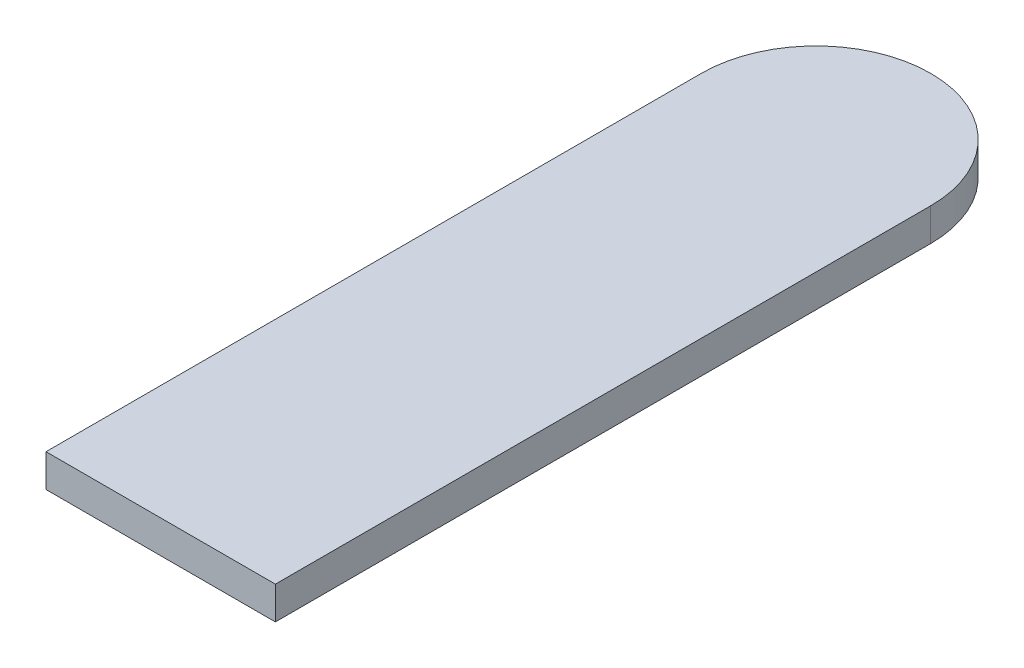
ISO-10303-21;
HEADER;
FILE_DESCRIPTION(('STEP AP214'),'2;1');
FILE_NAME('part.step','',(''),(''),'','','');
FILE_SCHEMA(('AUTOMOTIVE_DESIGN { 1 0 10303 214 1 1 1 1 }'));
ENDSEC;
DATA;
#1=APPLICATION_CONTEXT('core data for automotive mechanical design processes');
#2=APPLICATION_PROTOCOL_DEFINITION('international standard','automotive_design',2000,#1);
#3=PRODUCT_CONTEXT('',#1,'mechanical');
#4=PRODUCT('Part','Part','',(#3));
#5=PRODUCT_RELATED_PRODUCT_CATEGORY('part','',(#4));
#6=PRODUCT_DEFINITION_FORMATION('','',#4);
#7=PRODUCT_DEFINITION_CONTEXT('part definition',#1,'design');
#8=PRODUCT_DEFINITION('design','',#6,#7);
#9=PRODUCT_DEFINITION_SHAPE('','',#8);
#10=(LENGTH_UNIT() NAMED_UNIT(*) SI_UNIT(.MILLI.,.METRE.));
#11=(NAMED_UNIT(*) PLANE_ANGLE_UNIT() SI_UNIT($,.RADIAN.));
#12=(NAMED_UNIT(*) SI_UNIT($,.STERADIAN.) SOLID_ANGLE_UNIT());
#13=UNCERTAINTY_MEASURE_WITH_UNIT(LENGTH_MEASURE(1.E-05),#10,'distance_accuracy_value','');
#14=(GEOMETRIC_REPRESENTATION_CONTEXT(3) GLOBAL_UNCERTAINTY_ASSIGNED_CONTEXT((#13)) GLOBAL_UNIT_ASSIGNED_CONTEXT((#10,
#11,#12)) REPRESENTATION_CONTEXT('',''));
#15=CARTESIAN_POINT('',(0.,0.,0.));
#16=DIRECTION('',(0.,0.,1.));
#17=DIRECTION('',(1.,0.,0.));
#18=AXIS2_PLACEMENT_3D('',#15,#16,#17);
#19=CARTESIAN_POINT('',(0.,1.,0.));
#20=DIRECTION('',(-1.,0.,0.));
#21=DIRECTION('',(0.,0.,1.));
#22=AXIS2_PLACEMENT_3D('',#19,#20,#21);
#23=PLANE('',#22);
#24=DIRECTION('',(0.,0.,-1.));
#25=VECTOR('',#24,1.);
#26=CARTESIAN_POINT('',(0.,0.,0.));
#27=LINE('',#26,#25);
#28=CARTESIAN_POINT('',(0.,0.,0.));
#29=VERTEX_POINT('',#28);
#30=CARTESIAN_POINT('',(0.,0.,-20.));
#31=VERTEX_POINT('',#30);
#32=EDGE_CURVE('E107',#29,#31,#27,.T.);
#33=ORIENTED_EDGE('',*,*,#32,.T.);
#34=DIRECTION('',(0.,-1.,0.));
#35=VECTOR('',#34,1.);
#36=CARTESIAN_POINT('',(0.,1.,-20.));
#37=LINE('',#36,#35);
#38=CARTESIAN_POINT('',(0.,1.,-20.));
#39=VERTEX_POINT('',#38);
#40=EDGE_CURVE('E11',#39,#31,#37,.T.);
#41=ORIENTED_EDGE('',*,*,#40,.F.);
#42=DIRECTION('',(0.,0.,-1.));
#43=VECTOR('',#42,1.);
#44=CARTESIAN_POINT('',(0.,1.,0.));
#45=LINE('',#44,#43);
#46=CARTESIAN_POINT('',(0.,1.,0.));
#47=VERTEX_POINT('',#46);
#48=EDGE_CURVE('E91',#47,#39,#45,.T.);
#49=ORIENTED_EDGE('',*,*,#48,.F.);
#50=DIRECTION('',(0.,-1.,0.));
#51=VECTOR('',#50,1.);
#52=CARTESIAN_POINT('',(0.,1.,0.));
#53=LINE('',#52,#51);
#54=EDGE_CURVE('E103',#47,#29,#53,.T.);
#55=ORIENTED_EDGE('',*,*,#54,.T.);
#56=EDGE_LOOP('',(#33,#41,#49,#55));
#57=FACE_BOUND('',#56,.T.);
#58=ADVANCED_FACE('F39',(#57),#23,.F.);
#59=CARTESIAN_POINT('',(-3.5,1.,-20.));
#60=DIRECTION('',(0.,-1.,0.));
#61=DIRECTION('',(0.,0.,-1.));
#62=AXIS2_PLACEMENT_3D('',#59,#60,#61);
#63=CYLINDRICAL_SURFACE('',#62,3.5);
#64=CARTESIAN_POINT('',(-3.5,0.,-20.));
#65=DIRECTION('',(0.,1.,0.));
#66=DIRECTION('',(0.,0.,-1.));
#67=AXIS2_PLACEMENT_3D('',#64,#65,#66);
#68=CIRCLE('',#67,3.5);
#69=CARTESIAN_POINT('',(-7.,0.,-20.));
#70=VERTEX_POINT('',#69);
#71=EDGE_CURVE('E96',#31,#70,#68,.T.);
#72=ORIENTED_EDGE('',*,*,#71,.T.);
#73=DIRECTION('',(0.,-1.,0.));
#74=VECTOR('',#73,1.);
#75=CARTESIAN_POINT('',(-7.,1.,-20.));
#76=LINE('',#75,#74);
#77=CARTESIAN_POINT('',(-7.,1.,-20.));
#78=VERTEX_POINT('',#77);
#79=EDGE_CURVE('E48',#78,#70,#76,.T.);
#80=ORIENTED_EDGE('',*,*,#79,.F.);
#81=CARTESIAN_POINT('',(-3.5,1.,-20.));
#82=DIRECTION('',(0.,1.,0.));
#83=DIRECTION('',(0.,0.,-1.));
#84=AXIS2_PLACEMENT_3D('',#81,#82,#83);
#85=CIRCLE('',#84,3.5);
#86=EDGE_CURVE('E86',#39,#78,#85,.T.);
#87=ORIENTED_EDGE('',*,*,#86,.F.);
#88=ORIENTED_EDGE('',*,*,#40,.T.);
#89=EDGE_LOOP('',(#72,#80,#87,#88));
#90=FACE_BOUND('',#89,.T.);
#91=ADVANCED_FACE('F95',(#90),#63,.T.);
#92=CARTESIAN_POINT('',(-7.,1.,0.));
#93=DIRECTION('',(1.,0.,0.));
#94=DIRECTION('',(0.,0.,-1.));
#95=AXIS2_PLACEMENT_3D('',#92,#93,#94);
#96=PLANE('',#95);
#97=DIRECTION('',(0.,0.,1.));
#98=VECTOR('',#97,1.);
#99=CARTESIAN_POINT('',(-7.,0.,0.));
#100=LINE('',#99,#98);
#101=CARTESIAN_POINT('',(-7.,0.,0.));
#102=VERTEX_POINT('',#101);
#103=EDGE_CURVE('E73',#70,#102,#100,.T.);
#104=ORIENTED_EDGE('',*,*,#103,.T.);
#105=DIRECTION('',(0.,-1.,0.));
#106=VECTOR('',#105,1.);
#107=CARTESIAN_POINT('',(-7.,1.,0.));
#108=LINE('',#107,#106);
#109=CARTESIAN_POINT('',(-7.,1.,0.));
#110=VERTEX_POINT('',#109);
#111=EDGE_CURVE('E98',#110,#102,#108,.T.);
#112=ORIENTED_EDGE('',*,*,#111,.F.);
#113=DIRECTION('',(0.,0.,1.));
#114=VECTOR('',#113,1.);
#115=CARTESIAN_POINT('',(-7.,1.,0.));
#116=LINE('',#115,#114);
#117=EDGE_CURVE('E89',#78,#110,#116,.T.);
#118=ORIENTED_EDGE('',*,*,#117,.F.);
#119=ORIENTED_EDGE('',*,*,#79,.T.);
#120=EDGE_LOOP('',(#104,#112,#118,#119));
#121=FACE_BOUND('',#120,.T.);
#122=ADVANCED_FACE('F99',(#121),#96,.F.);
#123=CARTESIAN_POINT('',(0.,1.,0.));
#124=DIRECTION('',(0.,0.,-1.));
#125=DIRECTION('',(-1.,0.,0.));
#126=AXIS2_PLACEMENT_3D('',#123,#124,#125);
#127=PLANE('',#126);
#128=DIRECTION('',(1.,0.,0.));
#129=VECTOR('',#128,1.);
#130=CARTESIAN_POINT('',(0.,0.,0.));
#131=LINE('',#130,#129);
#132=EDGE_CURVE('E79',#102,#29,#131,.T.);
#133=ORIENTED_EDGE('',*,*,#132,.T.);
#134=ORIENTED_EDGE('',*,*,#54,.F.);
#135=DIRECTION('',(1.,0.,0.));
#136=VECTOR('',#135,1.);
#137=CARTESIAN_POINT('',(0.,1.,0.));
#138=LINE('',#137,#136);
#139=EDGE_CURVE('E56',#110,#47,#138,.T.);
#140=ORIENTED_EDGE('',*,*,#139,.F.);
#141=ORIENTED_EDGE('',*,*,#111,.T.);
#142=EDGE_LOOP('',(#133,#134,#140,#141));
#143=FACE_BOUND('',#142,.T.);
#144=ADVANCED_FACE('F120',(#143),#127,.F.);
#145=CARTESIAN_POINT('',(-3.5,1.,-20.));
#146=DIRECTION('',(0.,-1.,0.));
#147=DIRECTION('',(0.,0.,-1.));
#148=AXIS2_PLACEMENT_3D('',#145,#146,#147);
#149=PLANE('',#148);
#150=ORIENTED_EDGE('',*,*,#48,.T.);
#151=ORIENTED_EDGE('',*,*,#86,.T.);
#152=ORIENTED_EDGE('',*,*,#117,.T.);
#153=ORIENTED_EDGE('',*,*,#139,.T.);
#154=EDGE_LOOP('',(#150,#151,#152,#153));
#155=FACE_BOUND('',#154,.T.);
#156=ADVANCED_FACE('F87',(#155),#149,.F.);
#157=CARTESIAN_POINT('',(-3.5,0.,-20.));
#158=DIRECTION('',(0.,-1.,0.));
#159=DIRECTION('',(0.,0.,-1.));
#160=AXIS2_PLACEMENT_3D('',#157,#158,#159);
#161=PLANE('',#160);
#162=ORIENTED_EDGE('',*,*,#32,.F.);
#163=ORIENTED_EDGE('',*,*,#132,.F.);
#164=ORIENTED_EDGE('',*,*,#103,.F.);
#165=ORIENTED_EDGE('',*,*,#71,.F.);
#166=EDGE_LOOP('',(#162,#163,#164,#165));
#167=FACE_BOUND('',#166,.T.);
#168=ADVANCED_FACE('F123',(#167),#161,.T.);
#169=CLOSED_SHELL('',(#58,#91,#122,#144,#156,#168));
#170=MANIFOLD_SOLID_BREP('B2',#169);
#171=ADVANCED_BREP_SHAPE_REPRESENTATION('',(#18,#170),#14);
#172=SHAPE_DEFINITION_REPRESENTATION(#9,#171);
ENDSEC;
END-ISO-10303-21;
